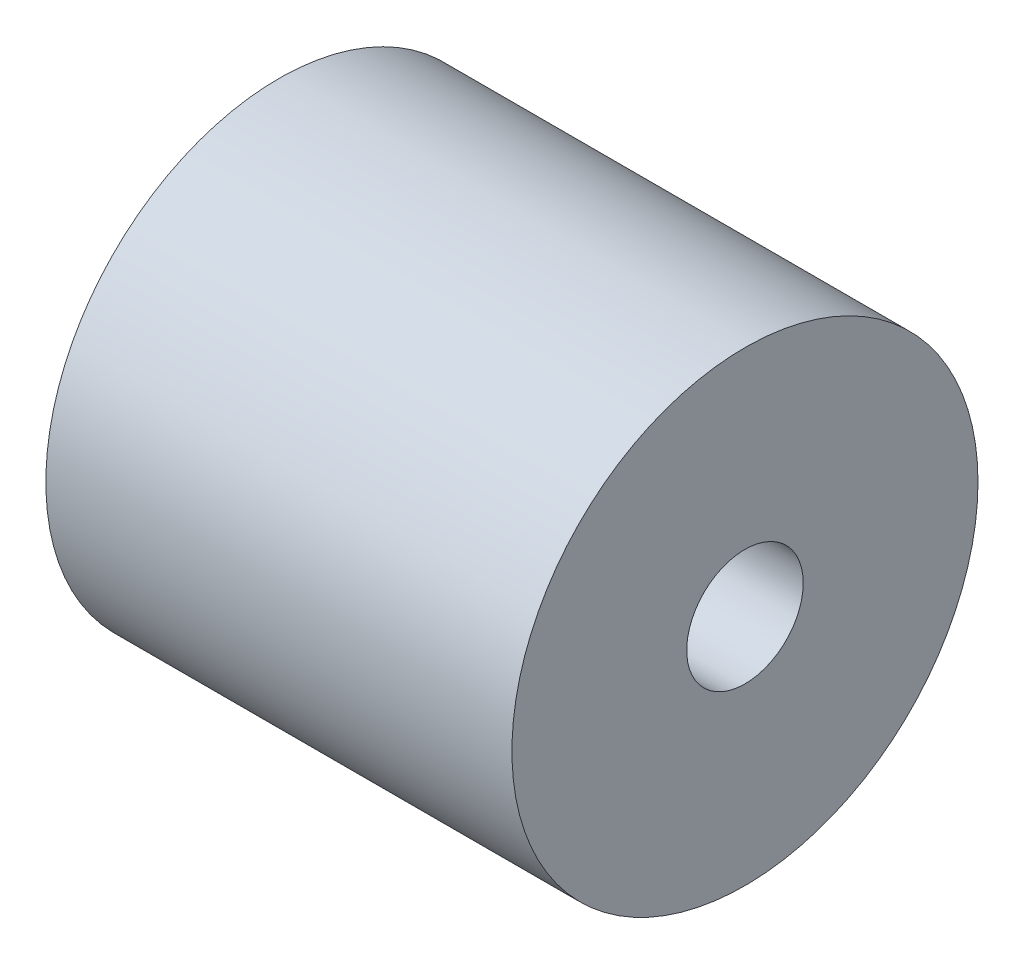
ISO-10303-21;
HEADER;
FILE_DESCRIPTION(('STEP AP214'),'2;1');
FILE_NAME('part.step','',(''),(''),'','','');
FILE_SCHEMA(('AUTOMOTIVE_DESIGN { 1 0 10303 214 1 1 1 1 }'));
ENDSEC;
DATA;
#1=APPLICATION_CONTEXT('core data for automotive mechanical design processes');
#2=APPLICATION_PROTOCOL_DEFINITION('international standard','automotive_design',2000,#1);
#3=PRODUCT_CONTEXT('',#1,'mechanical');
#4=PRODUCT('Part','Part','',(#3));
#5=PRODUCT_RELATED_PRODUCT_CATEGORY('part','',(#4));
#6=PRODUCT_DEFINITION_FORMATION('','',#4);
#7=PRODUCT_DEFINITION_CONTEXT('part definition',#1,'design');
#8=PRODUCT_DEFINITION('design','',#6,#7);
#9=PRODUCT_DEFINITION_SHAPE('','',#8);
#10=(LENGTH_UNIT() NAMED_UNIT(*) SI_UNIT(.MILLI.,.METRE.));
#11=(NAMED_UNIT(*) PLANE_ANGLE_UNIT() SI_UNIT($,.RADIAN.));
#12=(NAMED_UNIT(*) SI_UNIT($,.STERADIAN.) SOLID_ANGLE_UNIT());
#13=UNCERTAINTY_MEASURE_WITH_UNIT(LENGTH_MEASURE(1.E-05),#10,'distance_accuracy_value','');
#14=(GEOMETRIC_REPRESENTATION_CONTEXT(3) GLOBAL_UNCERTAINTY_ASSIGNED_CONTEXT((#13)) GLOBAL_UNIT_ASSIGNED_CONTEXT((#10,
#11,#12)) REPRESENTATION_CONTEXT('',''));
#15=CARTESIAN_POINT('',(0.,0.,0.));
#16=DIRECTION('',(0.,0.,1.));
#17=DIRECTION('',(1.,0.,0.));
#18=AXIS2_PLACEMENT_3D('',#15,#16,#17);
#19=CARTESIAN_POINT('',(26.0600000003,0.,0.));
#20=DIRECTION('',(1.,0.,0.));
#21=DIRECTION('',(0.,0.,-1.));
#22=AXIS2_PLACEMENT_3D('',#19,#20,#21);
#23=CYLINDRICAL_SURFACE('',#22,6.35);
#24=CARTESIAN_POINT('',(0.,0.,0.));
#25=DIRECTION('',(1.,0.,0.));
#26=DIRECTION('',(0.,0.,-1.));
#27=AXIS2_PLACEMENT_3D('',#24,#25,#26);
#28=CIRCLE('',#27,6.35);
#29=CARTESIAN_POINT('',(0.,0.,-6.35));
#30=VERTEX_POINT('',#29);
#31=EDGE_CURVE('E18',#30,#30,#28,.F.);
#32=ORIENTED_EDGE('',*,*,#31,.T.);
#33=EDGE_LOOP('',(#32));
#34=FACE_BOUND('',#33,.T.);
#35=CARTESIAN_POINT('',(50.8,0.,0.));
#36=DIRECTION('',(1.,0.,0.));
#37=DIRECTION('',(0.,0.,-1.));
#38=AXIS2_PLACEMENT_3D('',#35,#36,#37);
#39=CIRCLE('',#38,6.35);
#40=CARTESIAN_POINT('',(50.8,0.,-6.35));
#41=VERTEX_POINT('',#40);
#42=EDGE_CURVE('E27',#41,#41,#39,.F.);
#43=ORIENTED_EDGE('',*,*,#42,.F.);
#44=EDGE_LOOP('',(#43));
#45=FACE_BOUND('',#44,.T.);
#46=ADVANCED_FACE('F15',(#34,#45),#23,.F.);
#47=CARTESIAN_POINT('',(0.,0.,0.));
#48=DIRECTION('',(1.,0.,0.));
#49=DIRECTION('',(0.,0.,-1.));
#50=AXIS2_PLACEMENT_3D('',#47,#48,#49);
#51=PLANE('',#50);
#52=ORIENTED_EDGE('',*,*,#31,.F.);
#53=EDGE_LOOP('',(#52));
#54=FACE_BOUND('',#53,.T.);
#55=CARTESIAN_POINT('',(0.,0.,0.));
#56=DIRECTION('',(1.,0.,0.));
#57=DIRECTION('',(0.,0.,-1.));
#58=AXIS2_PLACEMENT_3D('',#55,#56,#57);
#59=CIRCLE('',#58,25.4);
#60=CARTESIAN_POINT('',(0.,0.,-25.4));
#61=VERTEX_POINT('',#60);
#62=EDGE_CURVE('E22',#61,#61,#59,.T.);
#63=ORIENTED_EDGE('',*,*,#62,.F.);
#64=EDGE_LOOP('',(#63));
#65=FACE_BOUND('',#64,.T.);
#66=ADVANCED_FACE('F37',(#54,#65),#51,.F.);
#67=CARTESIAN_POINT('',(50.8,0.,0.));
#68=DIRECTION('',(1.,0.,0.));
#69=DIRECTION('',(0.,0.,-1.));
#70=AXIS2_PLACEMENT_3D('',#67,#68,#69);
#71=PLANE('',#70);
#72=ORIENTED_EDGE('',*,*,#42,.T.);
#73=EDGE_LOOP('',(#72));
#74=FACE_BOUND('',#73,.T.);
#75=CARTESIAN_POINT('',(50.8,0.,0.));
#76=DIRECTION('',(1.,0.,0.));
#77=DIRECTION('',(0.,0.,-1.));
#78=AXIS2_PLACEMENT_3D('',#75,#76,#77);
#79=CIRCLE('',#78,25.4);
#80=CARTESIAN_POINT('',(50.8,0.,-25.4));
#81=VERTEX_POINT('',#80);
#82=EDGE_CURVE('E10',#81,#81,#79,.F.);
#83=ORIENTED_EDGE('',*,*,#82,.F.);
#84=EDGE_LOOP('',(#83));
#85=FACE_BOUND('',#84,.T.);
#86=ADVANCED_FACE('F40',(#74,#85),#71,.T.);
#87=CARTESIAN_POINT('',(25.4,0.,0.));
#88=DIRECTION('',(1.,0.,0.));
#89=DIRECTION('',(0.,0.,-1.));
#90=AXIS2_PLACEMENT_3D('',#87,#88,#89);
#91=CYLINDRICAL_SURFACE('',#90,25.4);
#92=ORIENTED_EDGE('',*,*,#62,.T.);
#93=EDGE_LOOP('',(#92));
#94=FACE_BOUND('',#93,.T.);
#95=ORIENTED_EDGE('',*,*,#82,.T.);
#96=EDGE_LOOP('',(#95));
#97=FACE_BOUND('',#96,.T.);
#98=ADVANCED_FACE('F43',(#94,#97),#91,.T.);
#99=CLOSED_SHELL('',(#46,#66,#86,#98));
#100=MANIFOLD_SOLID_BREP('B1',#99);
#101=ADVANCED_BREP_SHAPE_REPRESENTATION('',(#18,#100),#14);
#102=SHAPE_DEFINITION_REPRESENTATION(#9,#101);
ENDSEC;
END-ISO-10303-21;
